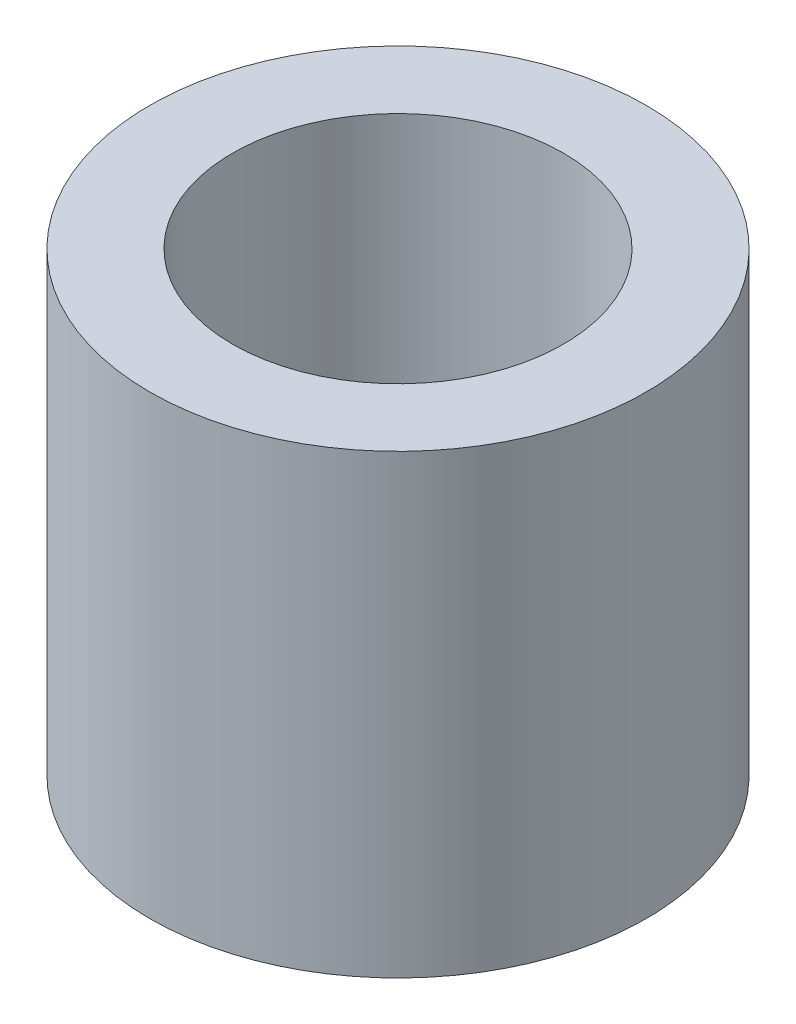
ISO-10303-21;
HEADER;
FILE_DESCRIPTION(('STEP AP214'),'2;1');
FILE_NAME('part.step','',(''),(''),'','','');
FILE_SCHEMA(('AUTOMOTIVE_DESIGN { 1 0 10303 214 1 1 1 1 }'));
ENDSEC;
DATA;
#1=APPLICATION_CONTEXT('core data for automotive mechanical design processes');
#2=APPLICATION_PROTOCOL_DEFINITION('international standard','automotive_design',2000,#1);
#3=PRODUCT_CONTEXT('',#1,'mechanical');
#4=PRODUCT('Part','Part','',(#3));
#5=PRODUCT_RELATED_PRODUCT_CATEGORY('part','',(#4));
#6=PRODUCT_DEFINITION_FORMATION('','',#4);
#7=PRODUCT_DEFINITION_CONTEXT('part definition',#1,'design');
#8=PRODUCT_DEFINITION('design','',#6,#7);
#9=PRODUCT_DEFINITION_SHAPE('','',#8);
#10=(LENGTH_UNIT() NAMED_UNIT(*) SI_UNIT(.MILLI.,.METRE.));
#11=(NAMED_UNIT(*) PLANE_ANGLE_UNIT() SI_UNIT($,.RADIAN.));
#12=(NAMED_UNIT(*) SI_UNIT($,.STERADIAN.) SOLID_ANGLE_UNIT());
#13=UNCERTAINTY_MEASURE_WITH_UNIT(LENGTH_MEASURE(1.E-05),#10,'distance_accuracy_value','');
#14=(GEOMETRIC_REPRESENTATION_CONTEXT(3) GLOBAL_UNCERTAINTY_ASSIGNED_CONTEXT((#13)) GLOBAL_UNIT_ASSIGNED_CONTEXT((#10,
#11,#12)) REPRESENTATION_CONTEXT('',''));
#15=CARTESIAN_POINT('',(0.,0.,0.));
#16=DIRECTION('',(0.,0.,1.));
#17=DIRECTION('',(1.,0.,0.));
#18=AXIS2_PLACEMENT_3D('',#15,#16,#17);
#19=CARTESIAN_POINT('',(0.,4.375,0.));
#20=DIRECTION('',(0.,1.,0.));
#21=DIRECTION('',(0.,0.,1.));
#22=AXIS2_PLACEMENT_3D('',#19,#20,#21);
#23=PLANE('',#22);
#24=CARTESIAN_POINT('',(0.,4.375,0.));
#25=DIRECTION('',(0.,1.,0.));
#26=DIRECTION('',(0.,0.,1.));
#27=AXIS2_PLACEMENT_3D('',#24,#25,#26);
#28=CIRCLE('',#27,2.38125);
#29=CARTESIAN_POINT('',(0.,4.375,2.38125));
#30=VERTEX_POINT('',#29);
#31=EDGE_CURVE('E10',#30,#30,#28,.T.);
#32=ORIENTED_EDGE('',*,*,#31,.T.);
#33=EDGE_LOOP('',(#32));
#34=FACE_BOUND('',#33,.T.);
#35=CARTESIAN_POINT('',(0.,4.375,0.));
#36=DIRECTION('',(0.,1.,0.));
#37=DIRECTION('',(0.,0.,1.));
#38=AXIS2_PLACEMENT_3D('',#35,#36,#37);
#39=CIRCLE('',#38,1.5875);
#40=CARTESIAN_POINT('',(0.,4.375,1.5875));
#41=VERTEX_POINT('',#40);
#42=EDGE_CURVE('E54',#41,#41,#39,.T.);
#43=ORIENTED_EDGE('',*,*,#42,.F.);
#44=EDGE_LOOP('',(#43));
#45=FACE_BOUND('',#44,.T.);
#46=ADVANCED_FACE('F41',(#34,#45),#23,.T.);
#47=CARTESIAN_POINT('',(0.,0.,0.));
#48=DIRECTION('',(0.,1.,0.));
#49=DIRECTION('',(0.,0.,1.));
#50=AXIS2_PLACEMENT_3D('',#47,#48,#49);
#51=PLANE('',#50);
#52=CARTESIAN_POINT('',(0.,0.,0.));
#53=DIRECTION('',(0.,1.,0.));
#54=DIRECTION('',(0.,0.,1.));
#55=AXIS2_PLACEMENT_3D('',#52,#53,#54);
#56=CIRCLE('',#55,2.38125);
#57=CARTESIAN_POINT('',(0.,0.,2.38125));
#58=VERTEX_POINT('',#57);
#59=EDGE_CURVE('E45',#58,#58,#56,.T.);
#60=ORIENTED_EDGE('',*,*,#59,.F.);
#61=EDGE_LOOP('',(#60));
#62=FACE_BOUND('',#61,.T.);
#63=CARTESIAN_POINT('',(0.,0.,0.));
#64=DIRECTION('',(0.,1.,0.));
#65=DIRECTION('',(0.,0.,1.));
#66=AXIS2_PLACEMENT_3D('',#63,#64,#65);
#67=CIRCLE('',#66,1.5875);
#68=CARTESIAN_POINT('',(0.,0.,1.5875));
#69=VERTEX_POINT('',#68);
#70=EDGE_CURVE('E56',#69,#69,#67,.T.);
#71=ORIENTED_EDGE('',*,*,#70,.T.);
#72=EDGE_LOOP('',(#71));
#73=FACE_BOUND('',#72,.T.);
#74=ADVANCED_FACE('F68',(#62,#73),#51,.F.);
#75=CARTESIAN_POINT('',(0.,4.375,0.));
#76=DIRECTION('',(0.,-1.,0.));
#77=DIRECTION('',(0.,0.,-1.));
#78=AXIS2_PLACEMENT_3D('',#75,#76,#77);
#79=CYLINDRICAL_SURFACE('',#78,2.38125);
#80=ORIENTED_EDGE('',*,*,#31,.F.);
#81=EDGE_LOOP('',(#80));
#82=FACE_BOUND('',#81,.T.);
#83=ORIENTED_EDGE('',*,*,#59,.T.);
#84=EDGE_LOOP('',(#83));
#85=FACE_BOUND('',#84,.T.);
#86=ADVANCED_FACE('F43',(#82,#85),#79,.T.);
#87=CARTESIAN_POINT('',(0.,4.375,0.));
#88=DIRECTION('',(0.,-1.,0.));
#89=DIRECTION('',(0.,0.,-1.));
#90=AXIS2_PLACEMENT_3D('',#87,#88,#89);
#91=CYLINDRICAL_SURFACE('',#90,1.5875);
#92=ORIENTED_EDGE('',*,*,#42,.T.);
#93=EDGE_LOOP('',(#92));
#94=FACE_BOUND('',#93,.T.);
#95=ORIENTED_EDGE('',*,*,#70,.F.);
#96=EDGE_LOOP('',(#95));
#97=FACE_BOUND('',#96,.T.);
#98=ADVANCED_FACE('F64',(#94,#97),#91,.F.);
#99=CLOSED_SHELL('',(#46,#74,#86,#98));
#100=MANIFOLD_SOLID_BREP('B2',#99);
#101=ADVANCED_BREP_SHAPE_REPRESENTATION('',(#18,#100),#14);
#102=SHAPE_DEFINITION_REPRESENTATION(#9,#101);
ENDSEC;
END-ISO-10303-21;
